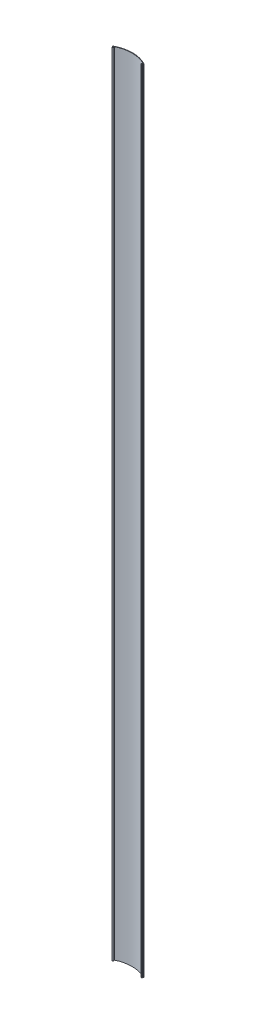
ISO-10303-21;
HEADER;
FILE_DESCRIPTION(('STEP AP214'),'2;1');
FILE_NAME('part.step','',(''),(''),'','','');
FILE_SCHEMA(('AUTOMOTIVE_DESIGN { 1 0 10303 214 1 1 1 1 }'));
ENDSEC;
DATA;
#1=APPLICATION_CONTEXT('core data for automotive mechanical design processes');
#2=APPLICATION_PROTOCOL_DEFINITION('international standard','automotive_design',2000,#1);
#3=PRODUCT_CONTEXT('',#1,'mechanical');
#4=PRODUCT('Part','Part','',(#3));
#5=PRODUCT_RELATED_PRODUCT_CATEGORY('part','',(#4));
#6=PRODUCT_DEFINITION_FORMATION('','',#4);
#7=PRODUCT_DEFINITION_CONTEXT('part definition',#1,'design');
#8=PRODUCT_DEFINITION('design','',#6,#7);
#9=PRODUCT_DEFINITION_SHAPE('','',#8);
#10=(LENGTH_UNIT() NAMED_UNIT(*) SI_UNIT(.MILLI.,.METRE.));
#11=(NAMED_UNIT(*) PLANE_ANGLE_UNIT() SI_UNIT($,.RADIAN.));
#12=(NAMED_UNIT(*) SI_UNIT($,.STERADIAN.) SOLID_ANGLE_UNIT());
#13=UNCERTAINTY_MEASURE_WITH_UNIT(LENGTH_MEASURE(1.E-05),#10,'distance_accuracy_value','');
#14=(GEOMETRIC_REPRESENTATION_CONTEXT(3) GLOBAL_UNCERTAINTY_ASSIGNED_CONTEXT((#13)) GLOBAL_UNIT_ASSIGNED_CONTEXT((#10,
#11,#12)) REPRESENTATION_CONTEXT('',''));
#15=CARTESIAN_POINT('',(0.,0.,0.));
#16=DIRECTION('',(0.,0.,1.));
#17=DIRECTION('',(1.,0.,0.));
#18=AXIS2_PLACEMENT_3D('',#15,#16,#17);
#19=CARTESIAN_POINT('',(50.79238,2590.8,88.9000000000001));
#20=DIRECTION('',(0.,-1.,0.));
#21=DIRECTION('',(0.,0.,-1.));
#22=AXIS2_PLACEMENT_3D('',#19,#20,#21);
#23=CYLINDRICAL_SURFACE('',#22,106.426);
#24=DIRECTION('',(0.,1.,0.));
#25=VECTOR('',#24,1.);
#26=CARTESIAN_POINT('',(3.8735765723203,-8.0994546011004,-6.62549063425299));
#27=LINE('',#26,#25);
#28=CARTESIAN_POINT('',(3.8735765723203,0.,-6.62549063425299));
#29=VERTEX_POINT('',#28);
#30=CARTESIAN_POINT('',(3.8735765723203,2590.8,-6.62549063425299));
#31=VERTEX_POINT('',#30);
#32=EDGE_CURVE('E242',#29,#31,#27,.T.);
#33=ORIENTED_EDGE('',*,*,#32,.F.);
#34=CARTESIAN_POINT('',(50.79238,0.,88.9000000000001));
#35=DIRECTION('',(0.,1.,0.));
#36=DIRECTION('',(0.,0.,1.));
#37=AXIS2_PLACEMENT_3D('',#34,#35,#36);
#38=CIRCLE('',#37,106.426);
#39=CARTESIAN_POINT('',(97.7111834276797,0.,-6.625490634253));
#40=VERTEX_POINT('',#39);
#41=EDGE_CURVE('E334',#40,#29,#38,.T.);
#42=ORIENTED_EDGE('',*,*,#41,.F.);
#43=DIRECTION('',(0.,1.,0.));
#44=VECTOR('',#43,1.);
#45=CARTESIAN_POINT('',(97.7111834276797,-8.0994546011004,-6.62549063425299));
#46=LINE('',#45,#44);
#47=CARTESIAN_POINT('',(97.7111834276797,2590.8,-6.62549063425299));
#48=VERTEX_POINT('',#47);
#49=EDGE_CURVE('E303',#40,#48,#46,.T.);
#50=ORIENTED_EDGE('',*,*,#49,.T.);
#51=CARTESIAN_POINT('',(50.79238,2590.8,88.9000000000001));
#52=DIRECTION('',(0.,1.,0.));
#53=DIRECTION('',(0.,0.,1.));
#54=AXIS2_PLACEMENT_3D('',#51,#52,#53);
#55=CIRCLE('',#54,106.426);
#56=EDGE_CURVE('E339',#48,#31,#55,.T.);
#57=ORIENTED_EDGE('',*,*,#56,.T.);
#58=EDGE_LOOP('',(#33,#42,#50,#57));
#59=FACE_BOUND('',#58,.T.);
#60=ADVANCED_FACE('F36',(#59),#23,.F.);
#61=CARTESIAN_POINT('',(101.58476,2590.8,0.));
#62=DIRECTION('',(1.,0.,0.));
#63=DIRECTION('',(0.,0.,-1.));
#64=AXIS2_PLACEMENT_3D('',#61,#62,#63);
#65=PLANE('',#64);
#66=DIRECTION('',(0.,1.,0.));
#67=VECTOR('',#66,1.);
#68=CARTESIAN_POINT('',(101.58476,0.,-5.59206360851805));
#69=LINE('',#68,#67);
#70=CARTESIAN_POINT('',(101.58476,0.,-5.59206360851805));
#71=VERTEX_POINT('',#70);
#72=CARTESIAN_POINT('',(101.58476,2590.8,-5.59206360851805));
#73=VERTEX_POINT('',#72);
#74=EDGE_CURVE('E322',#71,#73,#69,.T.);
#75=ORIENTED_EDGE('',*,*,#74,.F.);
#76=DIRECTION('',(0.,0.,1.));
#77=VECTOR('',#76,1.);
#78=CARTESIAN_POINT('',(101.58476,0.,0.));
#79=LINE('',#78,#77);
#80=CARTESIAN_POINT('',(101.58476,0.,-6.35406360851805));
#81=VERTEX_POINT('',#80);
#82=EDGE_CURVE('E325',#81,#71,#79,.T.);
#83=ORIENTED_EDGE('',*,*,#82,.F.);
#84=DIRECTION('',(0.,-1.,0.));
#85=VECTOR('',#84,1.);
#86=CARTESIAN_POINT('',(101.58476,2590.8,-6.35406360851805));
#87=LINE('',#86,#85);
#88=CARTESIAN_POINT('',(101.58476,2590.8,-6.35406360851805));
#89=VERTEX_POINT('',#88);
#90=EDGE_CURVE('E354',#89,#81,#87,.T.);
#91=ORIENTED_EDGE('',*,*,#90,.F.);
#92=DIRECTION('',(0.,0.,1.));
#93=VECTOR('',#92,1.);
#94=CARTESIAN_POINT('',(101.58476,2590.8,0.));
#95=LINE('',#94,#93);
#96=EDGE_CURVE('E330',#89,#73,#95,.T.);
#97=ORIENTED_EDGE('',*,*,#96,.T.);
#98=EDGE_LOOP('',(#75,#83,#91,#97));
#99=FACE_BOUND('',#98,.T.);
#100=ADVANCED_FACE('F455',(#99),#65,.T.);
#101=CARTESIAN_POINT('',(50.79238,2590.8,88.9000000000001));
#102=DIRECTION('',(0.,-1.,0.));
#103=DIRECTION('',(0.,0.,-1.));
#104=AXIS2_PLACEMENT_3D('',#101,#102,#103);
#105=CYLINDRICAL_SURFACE('',#104,107.95);
#106=CARTESIAN_POINT('',(50.79238,0.,88.9000000000001));
#107=DIRECTION('',(0.,1.,0.));
#108=DIRECTION('',(0.,0.,1.));
#109=AXIS2_PLACEMENT_3D('',#106,#107,#108);
#110=CIRCLE('',#109,107.95);
#111=CARTESIAN_POINT('',(0.,0.,-6.35406360851805));
#112=VERTEX_POINT('',#111);
#113=EDGE_CURVE('E345',#81,#112,#110,.T.);
#114=ORIENTED_EDGE('',*,*,#113,.T.);
#115=DIRECTION('',(0.,-1.,0.));
#116=VECTOR('',#115,1.);
#117=CARTESIAN_POINT('',(0.,2590.8,-6.35406360851805));
#118=LINE('',#117,#116);
#119=CARTESIAN_POINT('',(0.,2590.8,-6.35406360851805));
#120=VERTEX_POINT('',#119);
#121=EDGE_CURVE('E342',#120,#112,#118,.T.);
#122=ORIENTED_EDGE('',*,*,#121,.F.);
#123=CARTESIAN_POINT('',(50.79238,2590.8,88.9000000000001));
#124=DIRECTION('',(0.,1.,0.));
#125=DIRECTION('',(0.,0.,1.));
#126=AXIS2_PLACEMENT_3D('',#123,#124,#125);
#127=CIRCLE('',#126,107.95);
#128=EDGE_CURVE('E333',#89,#120,#127,.T.);
#129=ORIENTED_EDGE('',*,*,#128,.F.);
#130=ORIENTED_EDGE('',*,*,#90,.T.);
#131=EDGE_LOOP('',(#114,#122,#129,#130));
#132=FACE_BOUND('',#131,.T.);
#133=ADVANCED_FACE('F466',(#132),#105,.T.);
#134=CARTESIAN_POINT('',(0.,2590.8,0.));
#135=DIRECTION('',(-1.,0.,0.));
#136=DIRECTION('',(0.,0.,1.));
#137=AXIS2_PLACEMENT_3D('',#134,#135,#136);
#138=PLANE('',#137);
#139=DIRECTION('',(0.,1.,0.));
#140=VECTOR('',#139,1.);
#141=CARTESIAN_POINT('',(0.,0.,-5.59206360851805));
#142=LINE('',#141,#140);
#143=CARTESIAN_POINT('',(0.,0.,-5.59206360851805));
#144=VERTEX_POINT('',#143);
#145=CARTESIAN_POINT('',(0.,2590.8,-5.59206360851805));
#146=VERTEX_POINT('',#145);
#147=EDGE_CURVE('E326',#144,#146,#142,.T.);
#148=ORIENTED_EDGE('',*,*,#147,.T.);
#149=DIRECTION('',(0.,0.,-1.));
#150=VECTOR('',#149,1.);
#151=CARTESIAN_POINT('',(0.,2590.8,0.));
#152=LINE('',#151,#150);
#153=EDGE_CURVE('E337',#146,#120,#152,.T.);
#154=ORIENTED_EDGE('',*,*,#153,.T.);
#155=ORIENTED_EDGE('',*,*,#121,.T.);
#156=DIRECTION('',(0.,0.,-1.));
#157=VECTOR('',#156,1.);
#158=CARTESIAN_POINT('',(0.,0.,0.));
#159=LINE('',#158,#157);
#160=EDGE_CURVE('E348',#144,#112,#159,.T.);
#161=ORIENTED_EDGE('',*,*,#160,.F.);
#162=EDGE_LOOP('',(#148,#154,#155,#161));
#163=FACE_BOUND('',#162,.T.);
#164=ADVANCED_FACE('F448',(#163),#138,.T.);
#165=CARTESIAN_POINT('',(0.,2590.8,0.));
#166=DIRECTION('',(0.,1.,0.));
#167=DIRECTION('',(0.,0.,1.));
#168=AXIS2_PLACEMENT_3D('',#165,#166,#167);
#169=PLANE('',#168);
#170=DIRECTION('',(-0.342020143325663,0.,-0.939692620785911));
#171=VECTOR('',#170,1.);
#172=CARTESIAN_POINT('',(0.,2590.8,-5.59206360851805));
#173=LINE('',#172,#171);
#174=CARTESIAN_POINT('',(0.225023227207039,2590.8,-4.97381737291389));
#175=VERTEX_POINT('',#174);
#176=EDGE_CURVE('E278',#175,#146,#173,.T.);
#177=ORIENTED_EDGE('',*,*,#176,.F.);
#178=CARTESIAN_POINT('',(0.702387078566281,2590.8,-5.14756360572333));
#179=DIRECTION('',(0.,1.,0.));
#180=DIRECTION('',(0.,0.,1.));
#181=AXIS2_PLACEMENT_3D('',#178,#179,#180);
#182=CIRCLE('',#181,0.508);
#183=CARTESIAN_POINT('',(0.702387078566281,2590.8,-4.63956360572333));
#184=VERTEX_POINT('',#183);
#185=EDGE_CURVE('E363',#175,#184,#182,.T.);
#186=ORIENTED_EDGE('',*,*,#185,.T.);
#187=DIRECTION('',(1.,0.,0.));
#188=VECTOR('',#187,1.);
#189=CARTESIAN_POINT('',(0.,2590.8,-4.63956360572333));
#190=LINE('',#189,#188);
#191=CARTESIAN_POINT('',(2.79400000000006,2590.8,-4.63956360572333));
#192=VERTEX_POINT('',#191);
#193=EDGE_CURVE('E207',#184,#192,#190,.T.);
#194=ORIENTED_EDGE('',*,*,#193,.T.);
#195=CARTESIAN_POINT('',(2.79400000000006,2590.8,-3.43306360572333));
#196=DIRECTION('',(0.,1.,0.));
#197=DIRECTION('',(0.,0.,1.));
#198=AXIS2_PLACEMENT_3D('',#195,#196,#197);
#199=CIRCLE('',#198,1.2065);
#200=CARTESIAN_POINT('',(2.79400000000006,2590.8,-2.22656360572333));
#201=VERTEX_POINT('',#200);
#202=EDGE_CURVE('E201',#201,#192,#199,.T.);
#203=ORIENTED_EDGE('',*,*,#202,.F.);
#204=DIRECTION('',(-1.,0.,0.));
#205=VECTOR('',#204,1.);
#206=CARTESIAN_POINT('',(0.,2590.8,-2.22656360572333));
#207=LINE('',#206,#205);
#208=CARTESIAN_POINT('',(1.76906621500891,2590.8,-2.22656360572333));
#209=VERTEX_POINT('',#208);
#210=EDGE_CURVE('E214',#201,#209,#207,.T.);
#211=ORIENTED_EDGE('',*,*,#210,.T.);
#212=CARTESIAN_POINT('',(1.76906621500891,2590.8,-1.84556360572333));
#213=DIRECTION('',(0.,1.,0.));
#214=DIRECTION('',(0.,0.,1.));
#215=AXIS2_PLACEMENT_3D('',#212,#213,#214);
#216=CIRCLE('',#215,0.380999999999997);
#217=CARTESIAN_POINT('',(1.41104332648949,2590.8,-1.71525393111625));
#218=VERTEX_POINT('',#217);
#219=EDGE_CURVE('E221',#209,#218,#216,.T.);
#220=ORIENTED_EDGE('',*,*,#219,.T.);
#221=DIRECTION('',(0.342020143325688,0.,0.939692620785901));
#222=VECTOR('',#221,1.);
#223=CARTESIAN_POINT('',(1.79725460006727,2590.8,-0.654147177822537));
#224=LINE('',#223,#222);
#225=CARTESIAN_POINT('',(1.63748848128624,2590.8,-1.09310098156731));
#226=VERTEX_POINT('',#225);
#227=EDGE_CURVE('E223',#218,#226,#224,.T.);
#228=ORIENTED_EDGE('',*,*,#227,.T.);
#229=CARTESIAN_POINT('',(1.99551136980568,2590.8,-1.2234106561744));
#230=DIRECTION('',(0.,1.,0.));
#231=DIRECTION('',(0.,0.,1.));
#232=AXIS2_PLACEMENT_3D('',#229,#230,#231);
#233=CIRCLE('',#232,0.381000000000005);
#234=CARTESIAN_POINT('',(1.86602672707145,2590.8,-0.865088556247538));
#235=VERTEX_POINT('',#234);
#236=EDGE_CURVE('E229',#226,#235,#233,.T.);
#237=ORIENTED_EDGE('',*,*,#236,.T.);
#238=CARTESIAN_POINT('',(2.79400000000006,2590.8,-3.43306360572333));
#239=DIRECTION('',(0.,1.,0.));
#240=DIRECTION('',(0.,0.,1.));
#241=AXIS2_PLACEMENT_3D('',#238,#239,#240);
#242=CIRCLE('',#241,2.7305);
#243=CARTESIAN_POINT('',(3.88878320221033,2590.8,-5.93447920297187));
#244=VERTEX_POINT('',#243);
#245=EDGE_CURVE('E232',#235,#244,#242,.T.);
#246=ORIENTED_EDGE('',*,*,#245,.T.);
#247=CARTESIAN_POINT('',(4.04154364903037,2590.8,-6.28351393747166));
#248=DIRECTION('',(0.,1.,0.));
#249=DIRECTION('',(0.,0.,1.));
#250=AXIS2_PLACEMENT_3D('',#247,#248,#249);
#251=CIRCLE('',#250,0.380999999999998);
#252=EDGE_CURVE('E235',#244,#31,#251,.F.);
#253=ORIENTED_EDGE('',*,*,#252,.T.);
#254=ORIENTED_EDGE('',*,*,#56,.F.);
#255=CARTESIAN_POINT('',(97.5432163509696,2590.8,-6.28351393747166));
#256=DIRECTION('',(0.,1.,0.));
#257=DIRECTION('',(0.,0.,1.));
#258=AXIS2_PLACEMENT_3D('',#255,#256,#257);
#259=CIRCLE('',#258,0.380999999999998);
#260=CARTESIAN_POINT('',(97.6959767977897,2590.8,-5.93447920297186));
#261=VERTEX_POINT('',#260);
#262=EDGE_CURVE('E255',#261,#48,#259,.T.);
#263=ORIENTED_EDGE('',*,*,#262,.F.);
#264=CARTESIAN_POINT('',(98.7907599999999,2590.8,-3.43306360572333));
#265=DIRECTION('',(0.,1.,0.));
#266=DIRECTION('',(0.,0.,1.));
#267=AXIS2_PLACEMENT_3D('',#264,#265,#266);
#268=CIRCLE('',#267,2.7305);
#269=CARTESIAN_POINT('',(99.7187332729285,2590.8,-0.865088556247542));
#270=VERTEX_POINT('',#269);
#271=EDGE_CURVE('E280',#270,#261,#268,.F.);
#272=ORIENTED_EDGE('',*,*,#271,.F.);
#273=CARTESIAN_POINT('',(99.5892486301943,2590.8,-1.2234106561744));
#274=DIRECTION('',(0.,1.,0.));
#275=DIRECTION('',(0.,0.,1.));
#276=AXIS2_PLACEMENT_3D('',#273,#274,#275);
#277=CIRCLE('',#276,0.381000000000005);
#278=CARTESIAN_POINT('',(99.9472715187137,2590.8,-1.0931009815673));
#279=VERTEX_POINT('',#278);
#280=EDGE_CURVE('E283',#279,#270,#277,.F.);
#281=ORIENTED_EDGE('',*,*,#280,.F.);
#282=DIRECTION('',(-0.342020143325688,0.,0.939692620785901));
#283=VECTOR('',#282,1.);
#284=CARTESIAN_POINT('',(87.9043458517189,2590.8,31.9945653526694));
#285=LINE('',#284,#283);
#286=CARTESIAN_POINT('',(100.173716673511,2590.8,-1.71525393111625));
#287=VERTEX_POINT('',#286);
#288=EDGE_CURVE('E286',#287,#279,#285,.T.);
#289=ORIENTED_EDGE('',*,*,#288,.F.);
#290=CARTESIAN_POINT('',(99.8156937849911,2590.8,-1.84556360572333));
#291=DIRECTION('',(0.,1.,0.));
#292=DIRECTION('',(0.,0.,1.));
#293=AXIS2_PLACEMENT_3D('',#290,#291,#292);
#294=CIRCLE('',#293,0.380999999999997);
#295=CARTESIAN_POINT('',(99.8156937849911,2590.8,-2.22656360572333));
#296=VERTEX_POINT('',#295);
#297=EDGE_CURVE('E289',#296,#287,#294,.F.);
#298=ORIENTED_EDGE('',*,*,#297,.F.);
#299=DIRECTION('',(1.,0.,0.));
#300=VECTOR('',#299,1.);
#301=CARTESIAN_POINT('',(0.,2590.8,-2.22656360572333));
#302=LINE('',#301,#300);
#303=CARTESIAN_POINT('',(98.7907599999999,2590.8,-2.22656360572333));
#304=VERTEX_POINT('',#303);
#305=EDGE_CURVE('E292',#304,#296,#302,.T.);
#306=ORIENTED_EDGE('',*,*,#305,.F.);
#307=CARTESIAN_POINT('',(98.7907599999999,2590.8,-3.43306360572333));
#308=DIRECTION('',(0.,1.,0.));
#309=DIRECTION('',(0.,0.,1.));
#310=AXIS2_PLACEMENT_3D('',#307,#308,#309);
#311=CIRCLE('',#310,1.2065);
#312=CARTESIAN_POINT('',(98.7907599999999,2590.8,-4.63956360572333));
#313=VERTEX_POINT('',#312);
#314=EDGE_CURVE('E295',#304,#313,#311,.F.);
#315=ORIENTED_EDGE('',*,*,#314,.T.);
#316=DIRECTION('',(-1.,0.,0.));
#317=VECTOR('',#316,1.);
#318=CARTESIAN_POINT('',(0.,2590.8,-4.63956360572329));
#319=LINE('',#318,#317);
#320=CARTESIAN_POINT('',(100.882372921434,2590.8,-4.63956360572333));
#321=VERTEX_POINT('',#320);
#322=EDGE_CURVE('E298',#321,#313,#319,.T.);
#323=ORIENTED_EDGE('',*,*,#322,.F.);
#324=CARTESIAN_POINT('',(100.882372921434,2590.8,-5.14756360572333));
#325=DIRECTION('',(0.,1.,0.));
#326=DIRECTION('',(0.,0.,1.));
#327=AXIS2_PLACEMENT_3D('',#324,#325,#326);
#328=CIRCLE('',#327,0.508);
#329=CARTESIAN_POINT('',(101.359736772793,2590.8,-4.97381737291388));
#330=VERTEX_POINT('',#329);
#331=EDGE_CURVE('E361',#321,#330,#328,.T.);
#332=ORIENTED_EDGE('',*,*,#331,.T.);
#333=DIRECTION('',(0.342020143325686,0.,-0.939692620785902));
#334=VECTOR('',#333,1.);
#335=CARTESIAN_POINT('',(87.9043458517191,2590.8,31.9945653526693));
#336=LINE('',#335,#334);
#337=EDGE_CURVE('E300',#330,#73,#336,.T.);
#338=ORIENTED_EDGE('',*,*,#337,.T.);
#339=ORIENTED_EDGE('',*,*,#96,.F.);
#340=ORIENTED_EDGE('',*,*,#128,.T.);
#341=ORIENTED_EDGE('',*,*,#153,.F.);
#342=EDGE_LOOP('',(#177,#186,#194,#203,#211,#220,#228,#237,#246,#253,#254,#263,#272,#281,#289,
#298,#306,#315,#323,#332,#338,#339,#340,#341));
#343=FACE_BOUND('',#342,.T.);
#344=ADVANCED_FACE('F212',(#343),#169,.T.);
#345=CARTESIAN_POINT('',(0.,0.,0.));
#346=DIRECTION('',(0.,1.,0.));
#347=DIRECTION('',(0.,0.,1.));
#348=AXIS2_PLACEMENT_3D('',#345,#346,#347);
#349=PLANE('',#348);
#350=DIRECTION('',(-1.,0.,0.));
#351=VECTOR('',#350,1.);
#352=CARTESIAN_POINT('',(0.,0.,-4.63956360572333));
#353=LINE('',#352,#351);
#354=CARTESIAN_POINT('',(2.79400000000006,0.,-4.63956360572333));
#355=VERTEX_POINT('',#354);
#356=CARTESIAN_POINT('',(0.702387078566281,0.,-4.63956360572333));
#357=VERTEX_POINT('',#356);
#358=EDGE_CURVE('E426',#355,#357,#353,.T.);
#359=ORIENTED_EDGE('',*,*,#358,.T.);
#360=CARTESIAN_POINT('',(0.702387078566281,0.,-5.14756360572333));
#361=DIRECTION('',(0.,1.,0.));
#362=DIRECTION('',(0.,0.,1.));
#363=AXIS2_PLACEMENT_3D('',#360,#361,#362);
#364=CIRCLE('',#363,0.508);
#365=CARTESIAN_POINT('',(0.225023227207038,0.,-4.97381737291389));
#366=VERTEX_POINT('',#365);
#367=EDGE_CURVE('E368',#357,#366,#364,.F.);
#368=ORIENTED_EDGE('',*,*,#367,.T.);
#369=DIRECTION('',(-0.342020143325663,0.,-0.939692620785911));
#370=VECTOR('',#369,1.);
#371=CARTESIAN_POINT('',(1.79725460006717,0.,-0.654147177822447));
#372=LINE('',#371,#370);
#373=EDGE_CURVE('E356',#366,#144,#372,.T.);
#374=ORIENTED_EDGE('',*,*,#373,.T.);
#375=ORIENTED_EDGE('',*,*,#160,.T.);
#376=ORIENTED_EDGE('',*,*,#113,.F.);
#377=ORIENTED_EDGE('',*,*,#82,.T.);
#378=DIRECTION('',(-0.342020143325686,0.,0.939692620785902));
#379=VECTOR('',#378,1.);
#380=CARTESIAN_POINT('',(87.9043458517191,0.,31.9945653526693));
#381=LINE('',#380,#379);
#382=CARTESIAN_POINT('',(101.359736772793,0.,-4.97381737291388));
#383=VERTEX_POINT('',#382);
#384=EDGE_CURVE('E273',#71,#383,#381,.T.);
#385=ORIENTED_EDGE('',*,*,#384,.T.);
#386=CARTESIAN_POINT('',(100.882372921434,0.,-5.14756360572333));
#387=DIRECTION('',(0.,1.,0.));
#388=DIRECTION('',(0.,0.,1.));
#389=AXIS2_PLACEMENT_3D('',#386,#387,#388);
#390=CIRCLE('',#389,0.508);
#391=CARTESIAN_POINT('',(100.882372921434,0.,-4.63956360572333));
#392=VERTEX_POINT('',#391);
#393=EDGE_CURVE('E51',#383,#392,#390,.F.);
#394=ORIENTED_EDGE('',*,*,#393,.T.);
#395=DIRECTION('',(1.,0.,0.));
#396=VECTOR('',#395,1.);
#397=CARTESIAN_POINT('',(0.,0.,-4.63956360572329));
#398=LINE('',#397,#396);
#399=CARTESIAN_POINT('',(98.7907599999999,0.,-4.63956360572333));
#400=VERTEX_POINT('',#399);
#401=EDGE_CURVE('E271',#400,#392,#398,.T.);
#402=ORIENTED_EDGE('',*,*,#401,.F.);
#403=CARTESIAN_POINT('',(98.7907599999999,0.,-3.43306360572333));
#404=DIRECTION('',(0.,1.,0.));
#405=DIRECTION('',(0.,0.,1.));
#406=AXIS2_PLACEMENT_3D('',#403,#404,#405);
#407=CIRCLE('',#406,1.2065);
#408=CARTESIAN_POINT('',(98.7907599999999,0.,-2.22656360572333));
#409=VERTEX_POINT('',#408);
#410=EDGE_CURVE('E269',#400,#409,#407,.T.);
#411=ORIENTED_EDGE('',*,*,#410,.T.);
#412=DIRECTION('',(-1.,0.,0.));
#413=VECTOR('',#412,1.);
#414=CARTESIAN_POINT('',(0.,0.,-2.22656360572333));
#415=LINE('',#414,#413);
#416=CARTESIAN_POINT('',(99.8156937849911,0.,-2.22656360572332));
#417=VERTEX_POINT('',#416);
#418=EDGE_CURVE('E266',#417,#409,#415,.T.);
#419=ORIENTED_EDGE('',*,*,#418,.F.);
#420=CARTESIAN_POINT('',(99.8156937849911,0.,-1.84556360572333));
#421=DIRECTION('',(0.,1.,0.));
#422=DIRECTION('',(0.,0.,1.));
#423=AXIS2_PLACEMENT_3D('',#420,#421,#422);
#424=CIRCLE('',#423,0.380999999999997);
#425=CARTESIAN_POINT('',(100.173716673511,0.,-1.71525393111625));
#426=VERTEX_POINT('',#425);
#427=EDGE_CURVE('E263',#426,#417,#424,.T.);
#428=ORIENTED_EDGE('',*,*,#427,.F.);
#429=DIRECTION('',(0.342020143325688,0.,-0.939692620785902));
#430=VECTOR('',#429,1.);
#431=CARTESIAN_POINT('',(87.9043458517189,0.,31.9945653526694));
#432=LINE('',#431,#430);
#433=CARTESIAN_POINT('',(99.9472715187137,0.,-1.0931009815673));
#434=VERTEX_POINT('',#433);
#435=EDGE_CURVE('E259',#434,#426,#432,.T.);
#436=ORIENTED_EDGE('',*,*,#435,.F.);
#437=CARTESIAN_POINT('',(99.5892486301943,0.,-1.2234106561744));
#438=DIRECTION('',(0.,1.,0.));
#439=DIRECTION('',(0.,0.,1.));
#440=AXIS2_PLACEMENT_3D('',#437,#438,#439);
#441=CIRCLE('',#440,0.381000000000005);
#442=CARTESIAN_POINT('',(99.7187332729285,0.,-0.865088556247542));
#443=VERTEX_POINT('',#442);
#444=EDGE_CURVE('E256',#443,#434,#441,.T.);
#445=ORIENTED_EDGE('',*,*,#444,.F.);
#446=CARTESIAN_POINT('',(98.7907599999999,0.,-3.43306360572333));
#447=DIRECTION('',(0.,1.,0.));
#448=DIRECTION('',(0.,0.,1.));
#449=AXIS2_PLACEMENT_3D('',#446,#447,#448);
#450=CIRCLE('',#449,2.7305);
#451=CARTESIAN_POINT('',(97.6959767977897,0.,-5.93447920297186));
#452=VERTEX_POINT('',#451);
#453=EDGE_CURVE('E260',#452,#443,#450,.T.);
#454=ORIENTED_EDGE('',*,*,#453,.F.);
#455=CARTESIAN_POINT('',(97.5432163509696,0.,-6.28351393747166));
#456=DIRECTION('',(0.,1.,0.));
#457=DIRECTION('',(0.,0.,1.));
#458=AXIS2_PLACEMENT_3D('',#455,#456,#457);
#459=CIRCLE('',#458,0.380999999999998);
#460=EDGE_CURVE('E275',#40,#452,#459,.F.);
#461=ORIENTED_EDGE('',*,*,#460,.F.);
#462=ORIENTED_EDGE('',*,*,#41,.T.);
#463=CARTESIAN_POINT('',(4.04154364903037,0.,-6.28351393747166));
#464=DIRECTION('',(0.,1.,0.));
#465=DIRECTION('',(0.,0.,1.));
#466=AXIS2_PLACEMENT_3D('',#463,#464,#465);
#467=CIRCLE('',#466,0.380999999999998);
#468=CARTESIAN_POINT('',(3.88878320221032,0.,-5.93447920297186));
#469=VERTEX_POINT('',#468);
#470=EDGE_CURVE('E408',#29,#469,#467,.T.);
#471=ORIENTED_EDGE('',*,*,#470,.T.);
#472=CARTESIAN_POINT('',(2.79400000000006,0.,-3.43306360572333));
#473=DIRECTION('',(0.,1.,0.));
#474=DIRECTION('',(0.,0.,1.));
#475=AXIS2_PLACEMENT_3D('',#472,#473,#474);
#476=CIRCLE('',#475,2.7305);
#477=CARTESIAN_POINT('',(1.86602672707145,0.,-0.865088556247538));
#478=VERTEX_POINT('',#477);
#479=EDGE_CURVE('E422',#469,#478,#476,.F.);
#480=ORIENTED_EDGE('',*,*,#479,.T.);
#481=CARTESIAN_POINT('',(1.99551136980568,0.,-1.2234106561744));
#482=DIRECTION('',(0.,1.,0.));
#483=DIRECTION('',(0.,0.,1.));
#484=AXIS2_PLACEMENT_3D('',#481,#482,#483);
#485=CIRCLE('',#484,0.381000000000005);
#486=CARTESIAN_POINT('',(1.63748848128624,0.,-1.09310098156731));
#487=VERTEX_POINT('',#486);
#488=EDGE_CURVE('E424',#478,#487,#485,.F.);
#489=ORIENTED_EDGE('',*,*,#488,.T.);
#490=DIRECTION('',(-0.342020143325688,0.,-0.939692620785902));
#491=VECTOR('',#490,1.);
#492=CARTESIAN_POINT('',(1.79725460006727,0.,-0.654147177822537));
#493=LINE('',#492,#491);
#494=CARTESIAN_POINT('',(1.41104332648949,0.,-1.71525393111625));
#495=VERTEX_POINT('',#494);
#496=EDGE_CURVE('E428',#487,#495,#493,.T.);
#497=ORIENTED_EDGE('',*,*,#496,.T.);
#498=CARTESIAN_POINT('',(1.76906621500891,0.,-1.84556360572333));
#499=DIRECTION('',(0.,1.,0.));
#500=DIRECTION('',(0.,0.,1.));
#501=AXIS2_PLACEMENT_3D('',#498,#499,#500);
#502=CIRCLE('',#501,0.380999999999997);
#503=CARTESIAN_POINT('',(1.76906621500891,0.,-2.22656360572333));
#504=VERTEX_POINT('',#503);
#505=EDGE_CURVE('E241',#495,#504,#502,.F.);
#506=ORIENTED_EDGE('',*,*,#505,.T.);
#507=DIRECTION('',(1.,0.,0.));
#508=VECTOR('',#507,1.);
#509=CARTESIAN_POINT('',(0.,0.,-2.22656360572333));
#510=LINE('',#509,#508);
#511=CARTESIAN_POINT('',(2.79400000000006,0.,-2.22656360572333));
#512=VERTEX_POINT('',#511);
#513=EDGE_CURVE('E253',#504,#512,#510,.T.);
#514=ORIENTED_EDGE('',*,*,#513,.T.);
#515=CARTESIAN_POINT('',(2.79400000000006,0.,-3.43306360572333));
#516=DIRECTION('',(0.,1.,0.));
#517=DIRECTION('',(0.,0.,1.));
#518=AXIS2_PLACEMENT_3D('',#515,#516,#517);
#519=CIRCLE('',#518,1.2065);
#520=EDGE_CURVE('E202',#355,#512,#519,.F.);
#521=ORIENTED_EDGE('',*,*,#520,.F.);
#522=EDGE_LOOP('',(#359,#368,#374,#375,#376,#377,#385,#394,#402,#411,#419,#428,#436,#445,#454,
#461,#462,#471,#480,#489,#497,#506,#514,#521));
#523=FACE_BOUND('',#522,.T.);
#524=ADVANCED_FACE('F384',(#523),#349,.F.);
#525=CARTESIAN_POINT('',(0.,0.,-5.59206360851805));
#526=DIRECTION('',(0.939692620785911,0.,-0.342020143325663));
#527=DIRECTION('',(-0.342020143325663,0.,-0.939692620785911));
#528=AXIS2_PLACEMENT_3D('',#525,#526,#527);
#529=PLANE('',#528);
#530=ORIENTED_EDGE('',*,*,#373,.F.);
#531=DIRECTION('',(0.,1.,0.));
#532=VECTOR('',#531,1.);
#533=CARTESIAN_POINT('',(0.225023227207039,2590.8,-4.97381737291389));
#534=LINE('',#533,#532);
#535=EDGE_CURVE('E358',#366,#175,#534,.T.);
#536=ORIENTED_EDGE('',*,*,#535,.T.);
#537=ORIENTED_EDGE('',*,*,#176,.T.);
#538=ORIENTED_EDGE('',*,*,#147,.F.);
#539=EDGE_LOOP('',(#530,#536,#537,#538));
#540=FACE_BOUND('',#539,.T.);
#541=ADVANCED_FACE('F441',(#540),#529,.F.);
#542=CARTESIAN_POINT('',(98.7907599999999,-8.0994546011004,-3.43306360572333));
#543=DIRECTION('',(0.,1.,0.));
#544=DIRECTION('',(0.,0.,1.));
#545=AXIS2_PLACEMENT_3D('',#542,#543,#544);
#546=CYLINDRICAL_SURFACE('',#545,2.7305);
#547=DIRECTION('',(0.,1.,0.));
#548=VECTOR('',#547,1.);
#549=CARTESIAN_POINT('',(97.6959767977897,-8.0994546011004,-5.93447920297186));
#550=LINE('',#549,#548);
#551=EDGE_CURVE('E302',#452,#261,#550,.T.);
#552=ORIENTED_EDGE('',*,*,#551,.F.);
#553=ORIENTED_EDGE('',*,*,#453,.T.);
#554=DIRECTION('',(0.,1.,0.));
#555=VECTOR('',#554,1.);
#556=CARTESIAN_POINT('',(99.7187332729285,-8.0994546011004,-0.865088556247542));
#557=LINE('',#556,#555);
#558=EDGE_CURVE('E317',#443,#270,#557,.T.);
#559=ORIENTED_EDGE('',*,*,#558,.T.);
#560=ORIENTED_EDGE('',*,*,#271,.T.);
#561=EDGE_LOOP('',(#552,#553,#559,#560));
#562=FACE_BOUND('',#561,.T.);
#563=ADVANCED_FACE('F402',(#562),#546,.T.);
#564=CARTESIAN_POINT('',(99.5892486301943,-8.0994546011004,-1.2234106561744));
#565=DIRECTION('',(0.,1.,0.));
#566=DIRECTION('',(0.,0.,1.));
#567=AXIS2_PLACEMENT_3D('',#564,#565,#566);
#568=CYLINDRICAL_SURFACE('',#567,0.381000000000005);
#569=ORIENTED_EDGE('',*,*,#558,.F.);
#570=ORIENTED_EDGE('',*,*,#444,.T.);
#571=DIRECTION('',(0.,1.,0.));
#572=VECTOR('',#571,1.);
#573=CARTESIAN_POINT('',(99.9472715187137,-8.0994546011004,-1.0931009815673));
#574=LINE('',#573,#572);
#575=EDGE_CURVE('E315',#434,#279,#574,.T.);
#576=ORIENTED_EDGE('',*,*,#575,.T.);
#577=ORIENTED_EDGE('',*,*,#280,.T.);
#578=EDGE_LOOP('',(#569,#570,#576,#577));
#579=FACE_BOUND('',#578,.T.);
#580=ADVANCED_FACE('F397',(#579),#568,.T.);
#581=CARTESIAN_POINT('',(87.9043458517189,-8.0994546011004,31.9945653526694));
#582=DIRECTION('',(-0.939692620785902,0.,-0.342020143325688));
#583=DIRECTION('',(-0.342020143325688,0.,0.939692620785902));
#584=AXIS2_PLACEMENT_3D('',#581,#582,#583);
#585=PLANE('',#584);
#586=ORIENTED_EDGE('',*,*,#575,.F.);
#587=ORIENTED_EDGE('',*,*,#435,.T.);
#588=DIRECTION('',(0.,1.,0.));
#589=VECTOR('',#588,1.);
#590=CARTESIAN_POINT('',(100.173716673511,-8.0994546011004,-1.71525393111625));
#591=LINE('',#590,#589);
#592=EDGE_CURVE('E313',#426,#287,#591,.T.);
#593=ORIENTED_EDGE('',*,*,#592,.T.);
#594=ORIENTED_EDGE('',*,*,#288,.T.);
#595=EDGE_LOOP('',(#586,#587,#593,#594));
#596=FACE_BOUND('',#595,.T.);
#597=ADVANCED_FACE('F394',(#596),#585,.F.);
#598=CARTESIAN_POINT('',(99.8156937849911,-8.0994546011004,-1.84556360572333));
#599=DIRECTION('',(0.,1.,0.));
#600=DIRECTION('',(0.,0.,1.));
#601=AXIS2_PLACEMENT_3D('',#598,#599,#600);
#602=CYLINDRICAL_SURFACE('',#601,0.380999999999997);
#603=ORIENTED_EDGE('',*,*,#592,.F.);
#604=ORIENTED_EDGE('',*,*,#427,.T.);
#605=DIRECTION('',(0.,1.,0.));
#606=VECTOR('',#605,1.);
#607=CARTESIAN_POINT('',(99.8156937849911,-8.0994546011004,-2.22656360572333));
#608=LINE('',#607,#606);
#609=EDGE_CURVE('E311',#417,#296,#608,.T.);
#610=ORIENTED_EDGE('',*,*,#609,.T.);
#611=ORIENTED_EDGE('',*,*,#297,.T.);
#612=EDGE_LOOP('',(#603,#604,#610,#611));
#613=FACE_BOUND('',#612,.T.);
#614=ADVANCED_FACE('F390',(#613),#602,.T.);
#615=CARTESIAN_POINT('',(0.,-8.0994546011004,-2.22656360572333));
#616=DIRECTION('',(0.,0.,1.));
#617=DIRECTION('',(1.,0.,0.));
#618=AXIS2_PLACEMENT_3D('',#615,#616,#617);
#619=PLANE('',#618);
#620=ORIENTED_EDGE('',*,*,#609,.F.);
#621=ORIENTED_EDGE('',*,*,#418,.T.);
#622=DIRECTION('',(0.,1.,0.));
#623=VECTOR('',#622,1.);
#624=CARTESIAN_POINT('',(98.7907599999999,-8.0994546011004,-2.22656360572333));
#625=LINE('',#624,#623);
#626=EDGE_CURVE('E309',#409,#304,#625,.T.);
#627=ORIENTED_EDGE('',*,*,#626,.T.);
#628=ORIENTED_EDGE('',*,*,#305,.T.);
#629=EDGE_LOOP('',(#620,#621,#627,#628));
#630=FACE_BOUND('',#629,.T.);
#631=ADVANCED_FACE('F388',(#630),#619,.F.);
#632=CARTESIAN_POINT('',(98.7907599999999,-8.0994546011004,-3.43306360572333));
#633=DIRECTION('',(0.,1.,0.));
#634=DIRECTION('',(0.,0.,1.));
#635=AXIS2_PLACEMENT_3D('',#632,#633,#634);
#636=CYLINDRICAL_SURFACE('',#635,1.2065);
#637=ORIENTED_EDGE('',*,*,#410,.F.);
#638=DIRECTION('',(0.,1.,0.));
#639=VECTOR('',#638,1.);
#640=CARTESIAN_POINT('',(98.7907599999999,-8.0994546011004,-4.63956360572333));
#641=LINE('',#640,#639);
#642=EDGE_CURVE('E306',#400,#313,#641,.T.);
#643=ORIENTED_EDGE('',*,*,#642,.T.);
#644=ORIENTED_EDGE('',*,*,#314,.F.);
#645=ORIENTED_EDGE('',*,*,#626,.F.);
#646=EDGE_LOOP('',(#637,#643,#644,#645));
#647=FACE_BOUND('',#646,.T.);
#648=ADVANCED_FACE('F382',(#647),#636,.F.);
#649=CARTESIAN_POINT('',(0.,-8.0994546011004,-4.63956360572329));
#650=DIRECTION('',(0.,0.,-1.));
#651=DIRECTION('',(-1.,0.,0.));
#652=AXIS2_PLACEMENT_3D('',#649,#650,#651);
#653=PLANE('',#652);
#654=ORIENTED_EDGE('',*,*,#401,.T.);
#655=DIRECTION('',(0.,1.,0.));
#656=VECTOR('',#655,1.);
#657=CARTESIAN_POINT('',(100.882372921434,2590.8,-4.63956360572333));
#658=LINE('',#657,#656);
#659=EDGE_CURVE('E44',#392,#321,#658,.T.);
#660=ORIENTED_EDGE('',*,*,#659,.T.);
#661=ORIENTED_EDGE('',*,*,#322,.T.);
#662=ORIENTED_EDGE('',*,*,#642,.F.);
#663=EDGE_LOOP('',(#654,#660,#661,#662));
#664=FACE_BOUND('',#663,.T.);
#665=ADVANCED_FACE('F373',(#664),#653,.F.);
#666=CARTESIAN_POINT('',(87.9043458517191,-8.0994546011004,31.9945653526693));
#667=DIRECTION('',(0.939692620785902,0.,0.342020143325686));
#668=DIRECTION('',(0.342020143325686,0.,-0.939692620785902));
#669=AXIS2_PLACEMENT_3D('',#666,#667,#668);
#670=PLANE('',#669);
#671=ORIENTED_EDGE('',*,*,#337,.F.);
#672=DIRECTION('',(0.,1.,0.));
#673=VECTOR('',#672,1.);
#674=CARTESIAN_POINT('',(101.359736772793,0.,-4.97381737291388));
#675=LINE('',#674,#673);
#676=EDGE_CURVE('E11',#330,#383,#675,.F.);
#677=ORIENTED_EDGE('',*,*,#676,.T.);
#678=ORIENTED_EDGE('',*,*,#384,.F.);
#679=ORIENTED_EDGE('',*,*,#74,.T.);
#680=EDGE_LOOP('',(#671,#677,#678,#679));
#681=FACE_BOUND('',#680,.T.);
#682=ADVANCED_FACE('F456',(#681),#670,.T.);
#683=CARTESIAN_POINT('',(97.5432163509696,-8.0994546011004,-6.28351393747166));
#684=DIRECTION('',(0.,1.,0.));
#685=DIRECTION('',(0.,0.,1.));
#686=AXIS2_PLACEMENT_3D('',#683,#684,#685);
#687=CYLINDRICAL_SURFACE('',#686,0.380999999999998);
#688=ORIENTED_EDGE('',*,*,#49,.F.);
#689=ORIENTED_EDGE('',*,*,#460,.T.);
#690=ORIENTED_EDGE('',*,*,#551,.T.);
#691=ORIENTED_EDGE('',*,*,#262,.T.);
#692=EDGE_LOOP('',(#688,#689,#690,#691));
#693=FACE_BOUND('',#692,.T.);
#694=ADVANCED_FACE('F406',(#693),#687,.F.);
#695=CARTESIAN_POINT('',(2.79400000000006,-8.0994546011004,-3.43306360572333));
#696=DIRECTION('',(0.,1.,0.));
#697=DIRECTION('',(0.,0.,1.));
#698=AXIS2_PLACEMENT_3D('',#695,#696,#697);
#699=CYLINDRICAL_SURFACE('',#698,1.2065);
#700=DIRECTION('',(0.,1.,0.));
#701=VECTOR('',#700,1.);
#702=CARTESIAN_POINT('',(2.79400000000006,-8.0994546011004,-4.63956360572333));
#703=LINE('',#702,#701);
#704=EDGE_CURVE('E239',#355,#192,#703,.T.);
#705=ORIENTED_EDGE('',*,*,#704,.F.);
#706=ORIENTED_EDGE('',*,*,#520,.T.);
#707=DIRECTION('',(0.,1.,0.));
#708=VECTOR('',#707,1.);
#709=CARTESIAN_POINT('',(2.79400000000006,-8.0994546011004,-2.22656360572333));
#710=LINE('',#709,#708);
#711=EDGE_CURVE('E197',#512,#201,#710,.T.);
#712=ORIENTED_EDGE('',*,*,#711,.T.);
#713=ORIENTED_EDGE('',*,*,#202,.T.);
#714=EDGE_LOOP('',(#705,#706,#712,#713));
#715=FACE_BOUND('',#714,.T.);
#716=ADVANCED_FACE('F200',(#715),#699,.F.);
#717=CARTESIAN_POINT('',(0.,-8.0994546011004,-4.63956360572333));
#718=DIRECTION('',(0.,0.,1.));
#719=DIRECTION('',(1.,0.,0.));
#720=AXIS2_PLACEMENT_3D('',#717,#718,#719);
#721=PLANE('',#720);
#722=ORIENTED_EDGE('',*,*,#193,.F.);
#723=DIRECTION('',(0.,1.,0.));
#724=VECTOR('',#723,1.);
#725=CARTESIAN_POINT('',(0.702387078566281,0.,-4.63956360572333));
#726=LINE('',#725,#724);
#727=EDGE_CURVE('E365',#184,#357,#726,.F.);
#728=ORIENTED_EDGE('',*,*,#727,.T.);
#729=ORIENTED_EDGE('',*,*,#358,.F.);
#730=ORIENTED_EDGE('',*,*,#704,.T.);
#731=EDGE_LOOP('',(#722,#728,#729,#730));
#732=FACE_BOUND('',#731,.T.);
#733=ADVANCED_FACE('F560',(#732),#721,.T.);
#734=CARTESIAN_POINT('',(4.04154364903037,-8.0994546011004,-6.28351393747166));
#735=DIRECTION('',(0.,1.,0.));
#736=DIRECTION('',(0.,0.,1.));
#737=AXIS2_PLACEMENT_3D('',#734,#735,#736);
#738=CYLINDRICAL_SURFACE('',#737,0.380999999999998);
#739=ORIENTED_EDGE('',*,*,#470,.F.);
#740=ORIENTED_EDGE('',*,*,#32,.T.);
#741=ORIENTED_EDGE('',*,*,#252,.F.);
#742=DIRECTION('',(0.,1.,0.));
#743=VECTOR('',#742,1.);
#744=CARTESIAN_POINT('',(3.88878320221033,-8.0994546011004,-5.93447920297187));
#745=LINE('',#744,#743);
#746=EDGE_CURVE('E244',#469,#244,#745,.T.);
#747=ORIENTED_EDGE('',*,*,#746,.F.);
#748=EDGE_LOOP('',(#739,#740,#741,#747));
#749=FACE_BOUND('',#748,.T.);
#750=ADVANCED_FACE('F415',(#749),#738,.F.);
#751=CARTESIAN_POINT('',(2.79400000000006,-8.0994546011004,-3.43306360572333));
#752=DIRECTION('',(0.,1.,0.));
#753=DIRECTION('',(0.,0.,1.));
#754=AXIS2_PLACEMENT_3D('',#751,#752,#753);
#755=CYLINDRICAL_SURFACE('',#754,2.7305);
#756=ORIENTED_EDGE('',*,*,#479,.F.);
#757=ORIENTED_EDGE('',*,*,#746,.T.);
#758=ORIENTED_EDGE('',*,*,#245,.F.);
#759=DIRECTION('',(0.,1.,0.));
#760=VECTOR('',#759,1.);
#761=CARTESIAN_POINT('',(1.86602672707145,-8.0994546011004,-0.865088556247538));
#762=LINE('',#761,#760);
#763=EDGE_CURVE('E246',#478,#235,#762,.T.);
#764=ORIENTED_EDGE('',*,*,#763,.F.);
#765=EDGE_LOOP('',(#756,#757,#758,#764));
#766=FACE_BOUND('',#765,.T.);
#767=ADVANCED_FACE('F421',(#766),#755,.T.);
#768=CARTESIAN_POINT('',(1.99551136980568,-8.0994546011004,-1.2234106561744));
#769=DIRECTION('',(0.,1.,0.));
#770=DIRECTION('',(0.,0.,1.));
#771=AXIS2_PLACEMENT_3D('',#768,#769,#770);
#772=CYLINDRICAL_SURFACE('',#771,0.381000000000005);
#773=ORIENTED_EDGE('',*,*,#488,.F.);
#774=ORIENTED_EDGE('',*,*,#763,.T.);
#775=ORIENTED_EDGE('',*,*,#236,.F.);
#776=DIRECTION('',(0.,1.,0.));
#777=VECTOR('',#776,1.);
#778=CARTESIAN_POINT('',(1.63748848128624,-8.0994546011004,-1.09310098156731));
#779=LINE('',#778,#777);
#780=EDGE_CURVE('E248',#487,#226,#779,.T.);
#781=ORIENTED_EDGE('',*,*,#780,.F.);
#782=EDGE_LOOP('',(#773,#774,#775,#781));
#783=FACE_BOUND('',#782,.T.);
#784=ADVANCED_FACE('F579',(#783),#772,.T.);
#785=CARTESIAN_POINT('',(1.79725460006727,-8.0994546011004,-0.654147177822537));
#786=DIRECTION('',(-0.939692620785902,0.,0.342020143325688));
#787=DIRECTION('',(0.342020143325688,0.,0.939692620785902));
#788=AXIS2_PLACEMENT_3D('',#785,#786,#787);
#789=PLANE('',#788);
#790=ORIENTED_EDGE('',*,*,#496,.F.);
#791=ORIENTED_EDGE('',*,*,#780,.T.);
#792=ORIENTED_EDGE('',*,*,#227,.F.);
#793=DIRECTION('',(0.,1.,0.));
#794=VECTOR('',#793,1.);
#795=CARTESIAN_POINT('',(1.41104332648949,-8.0994546011004,-1.71525393111625));
#796=LINE('',#795,#794);
#797=EDGE_CURVE('E250',#495,#218,#796,.T.);
#798=ORIENTED_EDGE('',*,*,#797,.F.);
#799=EDGE_LOOP('',(#790,#791,#792,#798));
#800=FACE_BOUND('',#799,.T.);
#801=ADVANCED_FACE('F586',(#800),#789,.T.);
#802=CARTESIAN_POINT('',(1.76906621500891,-8.0994546011004,-1.84556360572333));
#803=DIRECTION('',(0.,1.,0.));
#804=DIRECTION('',(0.,0.,1.));
#805=AXIS2_PLACEMENT_3D('',#802,#803,#804);
#806=CYLINDRICAL_SURFACE('',#805,0.380999999999997);
#807=ORIENTED_EDGE('',*,*,#505,.F.);
#808=ORIENTED_EDGE('',*,*,#797,.T.);
#809=ORIENTED_EDGE('',*,*,#219,.F.);
#810=DIRECTION('',(0.,1.,0.));
#811=VECTOR('',#810,1.);
#812=CARTESIAN_POINT('',(1.76906621500891,-8.0994546011004,-2.22656360572333));
#813=LINE('',#812,#811);
#814=EDGE_CURVE('E206',#504,#209,#813,.T.);
#815=ORIENTED_EDGE('',*,*,#814,.F.);
#816=EDGE_LOOP('',(#807,#808,#809,#815));
#817=FACE_BOUND('',#816,.T.);
#818=ADVANCED_FACE('F594',(#817),#806,.T.);
#819=CARTESIAN_POINT('',(0.,-8.0994546011004,-2.22656360572333));
#820=DIRECTION('',(0.,0.,-1.));
#821=DIRECTION('',(-1.,0.,0.));
#822=AXIS2_PLACEMENT_3D('',#819,#820,#821);
#823=PLANE('',#822);
#824=ORIENTED_EDGE('',*,*,#513,.F.);
#825=ORIENTED_EDGE('',*,*,#814,.T.);
#826=ORIENTED_EDGE('',*,*,#210,.F.);
#827=ORIENTED_EDGE('',*,*,#711,.F.);
#828=EDGE_LOOP('',(#824,#825,#826,#827));
#829=FACE_BOUND('',#828,.T.);
#830=ADVANCED_FACE('F218',(#829),#823,.T.);
#831=CARTESIAN_POINT('',(0.702387078566281,0.,-5.14756360572333));
#832=DIRECTION('',(0.,-1.,0.));
#833=DIRECTION('',(0.,0.,-1.));
#834=AXIS2_PLACEMENT_3D('',#831,#832,#833);
#835=CYLINDRICAL_SURFACE('',#834,0.508);
#836=ORIENTED_EDGE('',*,*,#367,.F.);
#837=ORIENTED_EDGE('',*,*,#727,.F.);
#838=ORIENTED_EDGE('',*,*,#185,.F.);
#839=ORIENTED_EDGE('',*,*,#535,.F.);
#840=EDGE_LOOP('',(#836,#837,#838,#839));
#841=FACE_BOUND('',#840,.T.);
#842=ADVANCED_FACE('F439',(#841),#835,.T.);
#843=CARTESIAN_POINT('',(100.882372921434,-8.0994546011004,-5.14756360572333));
#844=DIRECTION('',(0.,-1.,0.));
#845=DIRECTION('',(0.,0.,-1.));
#846=AXIS2_PLACEMENT_3D('',#843,#844,#845);
#847=CYLINDRICAL_SURFACE('',#846,0.508);
#848=ORIENTED_EDGE('',*,*,#393,.F.);
#849=ORIENTED_EDGE('',*,*,#676,.F.);
#850=ORIENTED_EDGE('',*,*,#331,.F.);
#851=ORIENTED_EDGE('',*,*,#659,.F.);
#852=EDGE_LOOP('',(#848,#849,#850,#851));
#853=FACE_BOUND('',#852,.T.);
#854=ADVANCED_FACE('F38',(#853),#847,.T.);
#855=CLOSED_SHELL('',(#60,#100,#133,#164,#344,#524,#541,#563,#580,#597,#614,#631,#648,#665,#682,
#694,#716,#733,#750,#767,#784,#801,#818,#830,#842,#854));
#856=MANIFOLD_SOLID_BREP('B2',#855);
#857=ADVANCED_BREP_SHAPE_REPRESENTATION('',(#18,#856),#14);
#858=SHAPE_DEFINITION_REPRESENTATION(#9,#857);
ENDSEC;
END-ISO-10303-21;
